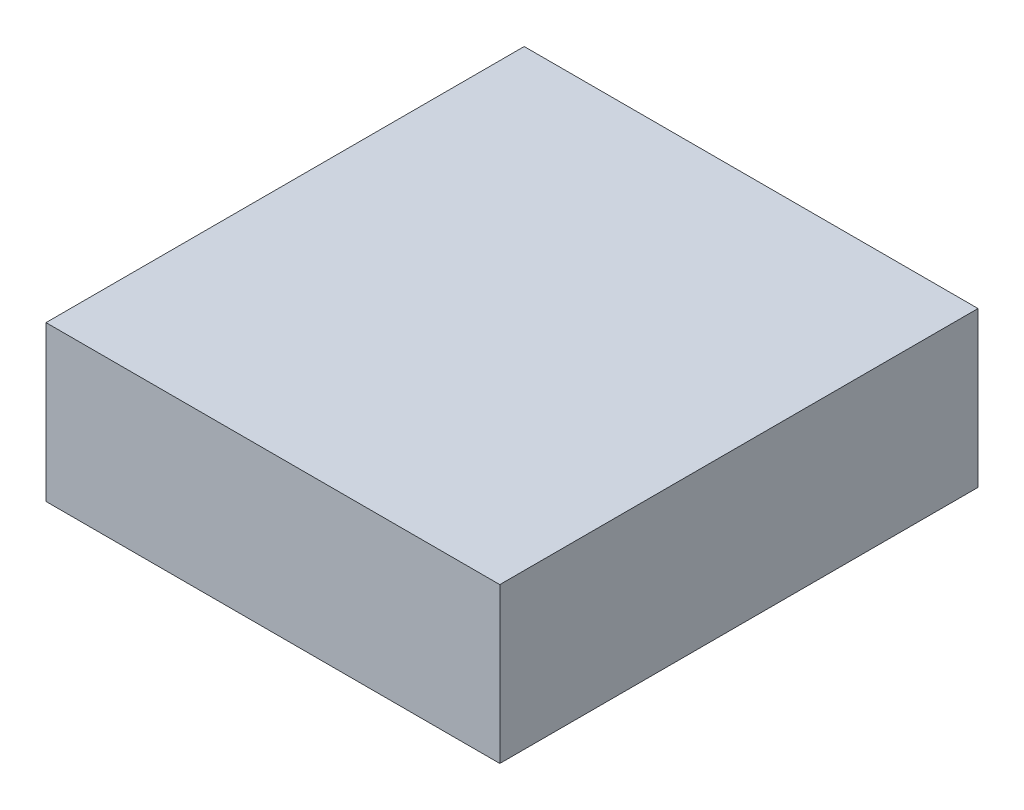
ISO-10303-21;
HEADER;
FILE_DESCRIPTION(('STEP AP214'),'2;1');
FILE_NAME('part.step','',(''),(''),'','','');
FILE_SCHEMA(('AUTOMOTIVE_DESIGN { 1 0 10303 214 1 1 1 1 }'));
ENDSEC;
DATA;
#1=APPLICATION_CONTEXT('core data for automotive mechanical design processes');
#2=APPLICATION_PROTOCOL_DEFINITION('international standard','automotive_design',2000,#1);
#3=PRODUCT_CONTEXT('',#1,'mechanical');
#4=PRODUCT('Part','Part','',(#3));
#5=PRODUCT_RELATED_PRODUCT_CATEGORY('part','',(#4));
#6=PRODUCT_DEFINITION_FORMATION('','',#4);
#7=PRODUCT_DEFINITION_CONTEXT('part definition',#1,'design');
#8=PRODUCT_DEFINITION('design','',#6,#7);
#9=PRODUCT_DEFINITION_SHAPE('','',#8);
#10=(LENGTH_UNIT() NAMED_UNIT(*) SI_UNIT(.MILLI.,.METRE.));
#11=(NAMED_UNIT(*) PLANE_ANGLE_UNIT() SI_UNIT($,.RADIAN.));
#12=(NAMED_UNIT(*) SI_UNIT($,.STERADIAN.) SOLID_ANGLE_UNIT());
#13=UNCERTAINTY_MEASURE_WITH_UNIT(LENGTH_MEASURE(1.E-05),#10,'distance_accuracy_value','');
#14=(GEOMETRIC_REPRESENTATION_CONTEXT(3) GLOBAL_UNCERTAINTY_ASSIGNED_CONTEXT((#13)) GLOBAL_UNIT_ASSIGNED_CONTEXT((#10,
#11,#12)) REPRESENTATION_CONTEXT('',''));
#15=CARTESIAN_POINT('',(0.,0.,0.));
#16=DIRECTION('',(0.,0.,1.));
#17=DIRECTION('',(1.,0.,0.));
#18=AXIS2_PLACEMENT_3D('',#15,#16,#17);
#19=CARTESIAN_POINT('',(0.47449232,-0.16199358,0.));
#20=DIRECTION('',(0.,-1.,0.));
#21=DIRECTION('',(0.,0.,-1.));
#22=AXIS2_PLACEMENT_3D('',#19,#20,#21);
#23=PLANE('',#22);
#24=DIRECTION('',(0.,0.,1.));
#25=VECTOR('',#24,1.);
#26=CARTESIAN_POINT('',(-0.47449232,-0.16199358,0.));
#27=LINE('',#26,#25);
#28=CARTESIAN_POINT('',(-0.47449232,-0.16199358,0.));
#29=VERTEX_POINT('',#28);
#30=CARTESIAN_POINT('',(-0.47449232,-0.16199358,1.00000054));
#31=VERTEX_POINT('',#30);
#32=EDGE_CURVE('E20',#29,#31,#27,.T.);
#33=ORIENTED_EDGE('',*,*,#32,.F.);
#34=DIRECTION('',(-1.,0.,0.));
#35=VECTOR('',#34,1.);
#36=CARTESIAN_POINT('',(0.,-0.16199358,0.));
#37=LINE('',#36,#35);
#38=CARTESIAN_POINT('',(0.47449232,-0.16199358,0.));
#39=VERTEX_POINT('',#38);
#40=EDGE_CURVE('E80',#39,#29,#37,.T.);
#41=ORIENTED_EDGE('',*,*,#40,.F.);
#42=DIRECTION('',(0.,0.,-1.));
#43=VECTOR('',#42,1.);
#44=CARTESIAN_POINT('',(0.47449232,-0.16199358,0.));
#45=LINE('',#44,#43);
#46=CARTESIAN_POINT('',(0.47449232,-0.16199358,1.00000054));
#47=VERTEX_POINT('',#46);
#48=EDGE_CURVE('E61',#47,#39,#45,.T.);
#49=ORIENTED_EDGE('',*,*,#48,.F.);
#50=DIRECTION('',(-1.,0.,0.));
#51=VECTOR('',#50,1.);
#52=CARTESIAN_POINT('',(0.,-0.16199358,1.00000054));
#53=LINE('',#52,#51);
#54=EDGE_CURVE('E55',#47,#31,#53,.T.);
#55=ORIENTED_EDGE('',*,*,#54,.T.);
#56=EDGE_LOOP('',(#33,#41,#49,#55));
#57=FACE_BOUND('',#56,.T.);
#58=ADVANCED_FACE('F17',(#57),#23,.T.);
#59=CARTESIAN_POINT('',(-0.47449232,-0.16199358,0.));
#60=DIRECTION('',(-1.,0.,0.));
#61=DIRECTION('',(0.,0.,1.));
#62=AXIS2_PLACEMENT_3D('',#59,#60,#61);
#63=PLANE('',#62);
#64=DIRECTION('',(0.,0.,1.));
#65=VECTOR('',#64,1.);
#66=CARTESIAN_POINT('',(-0.47449232,0.16199358,0.));
#67=LINE('',#66,#65);
#68=CARTESIAN_POINT('',(-0.47449232,0.16199358,0.));
#69=VERTEX_POINT('',#68);
#70=CARTESIAN_POINT('',(-0.47449232,0.16199358,1.00000054));
#71=VERTEX_POINT('',#70);
#72=EDGE_CURVE('E83',#69,#71,#67,.T.);
#73=ORIENTED_EDGE('',*,*,#72,.F.);
#74=DIRECTION('',(0.,1.,0.));
#75=VECTOR('',#74,1.);
#76=CARTESIAN_POINT('',(-0.47449232,0.,0.));
#77=LINE('',#76,#75);
#78=EDGE_CURVE('E68',#29,#69,#77,.T.);
#79=ORIENTED_EDGE('',*,*,#78,.F.);
#80=ORIENTED_EDGE('',*,*,#32,.T.);
#81=DIRECTION('',(0.,1.,0.));
#82=VECTOR('',#81,1.);
#83=CARTESIAN_POINT('',(-0.47449232,0.,1.00000054));
#84=LINE('',#83,#82);
#85=EDGE_CURVE('E63',#31,#71,#84,.T.);
#86=ORIENTED_EDGE('',*,*,#85,.T.);
#87=EDGE_LOOP('',(#73,#79,#80,#86));
#88=FACE_BOUND('',#87,.T.);
#89=ADVANCED_FACE('F65',(#88),#63,.T.);
#90=CARTESIAN_POINT('',(0.,0.,1.00000054));
#91=DIRECTION('',(0.,0.,-1.));
#92=DIRECTION('',(-1.,0.,0.));
#93=AXIS2_PLACEMENT_3D('',#90,#91,#92);
#94=PLANE('',#93);
#95=ORIENTED_EDGE('',*,*,#54,.F.);
#96=DIRECTION('',(0.,1.,0.));
#97=VECTOR('',#96,1.);
#98=CARTESIAN_POINT('',(0.47449232,0.16199358,1.00000054));
#99=LINE('',#98,#97);
#100=CARTESIAN_POINT('',(0.47449232,0.16199358,1.00000054));
#101=VERTEX_POINT('',#100);
#102=EDGE_CURVE('E74',#101,#47,#99,.F.);
#103=ORIENTED_EDGE('',*,*,#102,.F.);
#104=DIRECTION('',(1.,0.,0.));
#105=VECTOR('',#104,1.);
#106=CARTESIAN_POINT('',(-0.47449232,0.16199358,1.00000054));
#107=LINE('',#106,#105);
#108=EDGE_CURVE('E72',#71,#101,#107,.T.);
#109=ORIENTED_EDGE('',*,*,#108,.F.);
#110=ORIENTED_EDGE('',*,*,#85,.F.);
#111=EDGE_LOOP('',(#95,#103,#109,#110));
#112=FACE_BOUND('',#111,.T.);
#113=ADVANCED_FACE('F70',(#112),#94,.F.);
#114=CARTESIAN_POINT('',(0.47449232,0.16199358,0.));
#115=DIRECTION('',(1.,0.,0.));
#116=DIRECTION('',(0.,0.,-1.));
#117=AXIS2_PLACEMENT_3D('',#114,#115,#116);
#118=PLANE('',#117);
#119=ORIENTED_EDGE('',*,*,#48,.T.);
#120=DIRECTION('',(0.,1.,0.));
#121=VECTOR('',#120,1.);
#122=CARTESIAN_POINT('',(0.47449232,0.,0.));
#123=LINE('',#122,#121);
#124=CARTESIAN_POINT('',(0.47449232,0.16199358,0.));
#125=VERTEX_POINT('',#124);
#126=EDGE_CURVE('E35',#125,#39,#123,.F.);
#127=ORIENTED_EDGE('',*,*,#126,.F.);
#128=DIRECTION('',(0.,0.,1.));
#129=VECTOR('',#128,1.);
#130=CARTESIAN_POINT('',(0.47449232,0.16199358,0.));
#131=LINE('',#130,#129);
#132=EDGE_CURVE('E26',#101,#125,#131,.F.);
#133=ORIENTED_EDGE('',*,*,#132,.F.);
#134=ORIENTED_EDGE('',*,*,#102,.T.);
#135=EDGE_LOOP('',(#119,#127,#133,#134));
#136=FACE_BOUND('',#135,.T.);
#137=ADVANCED_FACE('F89',(#136),#118,.T.);
#138=CARTESIAN_POINT('',(0.,0.,0.));
#139=DIRECTION('',(0.,0.,-1.));
#140=DIRECTION('',(-1.,0.,0.));
#141=AXIS2_PLACEMENT_3D('',#138,#139,#140);
#142=PLANE('',#141);
#143=ORIENTED_EDGE('',*,*,#40,.T.);
#144=ORIENTED_EDGE('',*,*,#78,.T.);
#145=DIRECTION('',(1.,0.,0.));
#146=VECTOR('',#145,1.);
#147=CARTESIAN_POINT('',(-0.47449232,0.16199358,0.));
#148=LINE('',#147,#146);
#149=EDGE_CURVE('E11',#125,#69,#148,.F.);
#150=ORIENTED_EDGE('',*,*,#149,.F.);
#151=ORIENTED_EDGE('',*,*,#126,.T.);
#152=EDGE_LOOP('',(#143,#144,#150,#151));
#153=FACE_BOUND('',#152,.T.);
#154=ADVANCED_FACE('F91',(#153),#142,.T.);
#155=CARTESIAN_POINT('',(-0.47449232,0.16199358,0.));
#156=DIRECTION('',(0.,1.,0.));
#157=DIRECTION('',(0.,0.,1.));
#158=AXIS2_PLACEMENT_3D('',#155,#156,#157);
#159=PLANE('',#158);
#160=ORIENTED_EDGE('',*,*,#132,.T.);
#161=ORIENTED_EDGE('',*,*,#149,.T.);
#162=ORIENTED_EDGE('',*,*,#72,.T.);
#163=ORIENTED_EDGE('',*,*,#108,.T.);
#164=EDGE_LOOP('',(#160,#161,#162,#163));
#165=FACE_BOUND('',#164,.T.);
#166=ADVANCED_FACE('F88',(#165),#159,.T.);
#167=CLOSED_SHELL('',(#58,#89,#113,#137,#154,#166));
#168=MANIFOLD_SOLID_BREP('B1',#167);
#169=ADVANCED_BREP_SHAPE_REPRESENTATION('',(#18,#168),#14);
#170=SHAPE_DEFINITION_REPRESENTATION(#9,#169);
ENDSEC;
END-ISO-10303-21;
